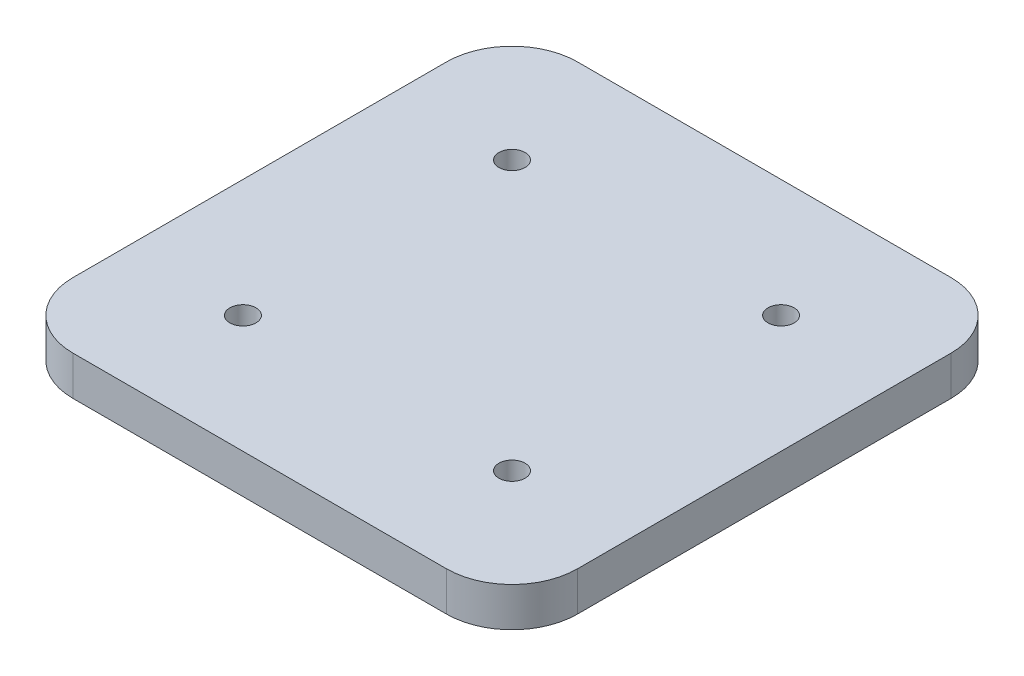
ISO-10303-21;
HEADER;
FILE_DESCRIPTION(('STEP AP214'),'2;1');
FILE_NAME('part.step','',(''),(''),'','','');
FILE_SCHEMA(('AUTOMOTIVE_DESIGN { 1 0 10303 214 1 1 1 1 }'));
ENDSEC;
DATA;
#1=APPLICATION_CONTEXT('core data for automotive mechanical design processes');
#2=APPLICATION_PROTOCOL_DEFINITION('international standard','automotive_design',2000,#1);
#3=PRODUCT_CONTEXT('',#1,'mechanical');
#4=PRODUCT('Part','Part','',(#3));
#5=PRODUCT_RELATED_PRODUCT_CATEGORY('part','',(#4));
#6=PRODUCT_DEFINITION_FORMATION('','',#4);
#7=PRODUCT_DEFINITION_CONTEXT('part definition',#1,'design');
#8=PRODUCT_DEFINITION('design','',#6,#7);
#9=PRODUCT_DEFINITION_SHAPE('','',#8);
#10=(LENGTH_UNIT() NAMED_UNIT(*) SI_UNIT(.MILLI.,.METRE.));
#11=(NAMED_UNIT(*) PLANE_ANGLE_UNIT() SI_UNIT($,.RADIAN.));
#12=(NAMED_UNIT(*) SI_UNIT($,.STERADIAN.) SOLID_ANGLE_UNIT());
#13=UNCERTAINTY_MEASURE_WITH_UNIT(LENGTH_MEASURE(1.E-05),#10,'distance_accuracy_value','');
#14=(GEOMETRIC_REPRESENTATION_CONTEXT(3) GLOBAL_UNCERTAINTY_ASSIGNED_CONTEXT((#13)) GLOBAL_UNIT_ASSIGNED_CONTEXT((#10,
#11,#12)) REPRESENTATION_CONTEXT('',''));
#15=CARTESIAN_POINT('',(0.,0.,0.));
#16=DIRECTION('',(0.,0.,1.));
#17=DIRECTION('',(1.,0.,0.));
#18=AXIS2_PLACEMENT_3D('',#15,#16,#17);
#19=CARTESIAN_POINT('',(25.4189986949346,71.5000000000009,-0.0199999999986694));
#20=DIRECTION('',(-1.,0.,0.));
#21=DIRECTION('',(0.,0.,1.));
#22=AXIS2_PLACEMENT_3D('',#19,#20,#21);
#23=PLANE('',#22);
#24=DIRECTION('',(0.,0.,-1.));
#25=VECTOR('',#24,1.);
#26=CARTESIAN_POINT('',(25.4189986949346,71.5000000000009,-0.0199999999986694));
#27=LINE('',#26,#25);
#28=CARTESIAN_POINT('',(25.4189986949346,71.5000000000009,-10.0199999999987));
#29=VERTEX_POINT('',#28);
#30=CARTESIAN_POINT('',(25.4189986949346,71.5000000000009,-67.1699999999987));
#31=VERTEX_POINT('',#30);
#32=EDGE_CURVE('E157',#29,#31,#27,.T.);
#33=ORIENTED_EDGE('',*,*,#32,.T.);
#34=DIRECTION('',(0.,-1.,0.));
#35=VECTOR('',#34,1.);
#36=CARTESIAN_POINT('',(25.4189986949346,71.5000000000009,-67.1699999999987));
#37=LINE('',#36,#35);
#38=CARTESIAN_POINT('',(25.4189986949346,65.5000000000009,-67.1699999999987));
#39=VERTEX_POINT('',#38);
#40=EDGE_CURVE('E11',#31,#39,#37,.T.);
#41=ORIENTED_EDGE('',*,*,#40,.T.);
#42=DIRECTION('',(0.,0.,-1.));
#43=VECTOR('',#42,1.);
#44=CARTESIAN_POINT('',(25.4189986949346,65.5000000000009,-0.0199999999986694));
#45=LINE('',#44,#43);
#46=CARTESIAN_POINT('',(25.4189986949346,65.5000000000009,-10.0199999999987));
#47=VERTEX_POINT('',#46);
#48=EDGE_CURVE('E160',#47,#39,#45,.T.);
#49=ORIENTED_EDGE('',*,*,#48,.F.);
#50=DIRECTION('',(0.,-1.,0.));
#51=VECTOR('',#50,1.);
#52=CARTESIAN_POINT('',(25.4189986949346,71.5000000000009,-10.0199999999987));
#53=LINE('',#52,#51);
#54=EDGE_CURVE('E43',#47,#29,#53,.F.);
#55=ORIENTED_EDGE('',*,*,#54,.T.);
#56=EDGE_LOOP('',(#33,#41,#49,#55));
#57=FACE_BOUND('',#56,.T.);
#58=ADVANCED_FACE('F35',(#57),#23,.T.);
#59=CARTESIAN_POINT('',(102.568998694935,71.5000000000009,-0.01999999999866));
#60=DIRECTION('',(0.,0.,1.));
#61=DIRECTION('',(1.,0.,0.));
#62=AXIS2_PLACEMENT_3D('',#59,#60,#61);
#63=PLANE('',#62);
#64=DIRECTION('',(-1.,0.,0.));
#65=VECTOR('',#64,1.);
#66=CARTESIAN_POINT('',(102.568998694935,65.5000000000009,-0.01999999999866));
#67=LINE('',#66,#65);
#68=CARTESIAN_POINT('',(92.5689986949346,65.5000000000009,-0.0199999999986612));
#69=VERTEX_POINT('',#68);
#70=CARTESIAN_POINT('',(35.4189986949346,65.5000000000009,-0.0199999999986682));
#71=VERTEX_POINT('',#70);
#72=EDGE_CURVE('E121',#69,#71,#67,.T.);
#73=ORIENTED_EDGE('',*,*,#72,.F.);
#74=DIRECTION('',(0.,-1.,0.));
#75=VECTOR('',#74,1.);
#76=CARTESIAN_POINT('',(92.5689986949346,71.5000000000009,-0.0199999999986612));
#77=LINE('',#76,#75);
#78=CARTESIAN_POINT('',(92.5689986949346,71.5000000000009,-0.0199999999986612));
#79=VERTEX_POINT('',#78);
#80=EDGE_CURVE('E141',#69,#79,#77,.F.);
#81=ORIENTED_EDGE('',*,*,#80,.T.);
#82=DIRECTION('',(-1.,0.,0.));
#83=VECTOR('',#82,1.);
#84=CARTESIAN_POINT('',(102.568998694935,71.5000000000009,-0.01999999999866));
#85=LINE('',#84,#83);
#86=CARTESIAN_POINT('',(35.4189986949346,71.5000000000009,-0.0199999999986682));
#87=VERTEX_POINT('',#86);
#88=EDGE_CURVE('E124',#79,#87,#85,.T.);
#89=ORIENTED_EDGE('',*,*,#88,.T.);
#90=DIRECTION('',(0.,-1.,0.));
#91=VECTOR('',#90,1.);
#92=CARTESIAN_POINT('',(35.4189986949346,71.5000000000009,-0.0199999999986682));
#93=LINE('',#92,#91);
#94=EDGE_CURVE('E138',#87,#71,#93,.T.);
#95=ORIENTED_EDGE('',*,*,#94,.T.);
#96=EDGE_LOOP('',(#73,#81,#89,#95));
#97=FACE_BOUND('',#96,.T.);
#98=ADVANCED_FACE('F172',(#97),#63,.T.);
#99=CARTESIAN_POINT('',(102.568998694935,71.5000000000009,-77.1699999999987));
#100=DIRECTION('',(1.,0.,0.));
#101=DIRECTION('',(0.,0.,-1.));
#102=AXIS2_PLACEMENT_3D('',#99,#100,#101);
#103=PLANE('',#102);
#104=DIRECTION('',(0.,0.,1.));
#105=VECTOR('',#104,1.);
#106=CARTESIAN_POINT('',(102.568998694935,71.5000000000009,-77.1699999999987));
#107=LINE('',#106,#105);
#108=CARTESIAN_POINT('',(102.568998694935,71.5000000000009,-67.1699999999987));
#109=VERTEX_POINT('',#108);
#110=CARTESIAN_POINT('',(102.568998694935,71.5000000000009,-10.0199999999987));
#111=VERTEX_POINT('',#110);
#112=EDGE_CURVE('E129',#109,#111,#107,.T.);
#113=ORIENTED_EDGE('',*,*,#112,.T.);
#114=DIRECTION('',(0.,-1.,0.));
#115=VECTOR('',#114,1.);
#116=CARTESIAN_POINT('',(102.568998694935,71.5000000000009,-10.0199999999987));
#117=LINE('',#116,#115);
#118=CARTESIAN_POINT('',(102.568998694935,65.5000000000009,-10.0199999999987));
#119=VERTEX_POINT('',#118);
#120=EDGE_CURVE('E120',#111,#119,#117,.T.);
#121=ORIENTED_EDGE('',*,*,#120,.T.);
#122=DIRECTION('',(0.,0.,1.));
#123=VECTOR('',#122,1.);
#124=CARTESIAN_POINT('',(102.568998694935,65.5000000000009,-77.1699999999987));
#125=LINE('',#124,#123);
#126=CARTESIAN_POINT('',(102.568998694935,65.5000000000009,-67.1699999999987));
#127=VERTEX_POINT('',#126);
#128=EDGE_CURVE('E105',#127,#119,#125,.T.);
#129=ORIENTED_EDGE('',*,*,#128,.F.);
#130=DIRECTION('',(0.,-1.,0.));
#131=VECTOR('',#130,1.);
#132=CARTESIAN_POINT('',(102.568998694935,71.5000000000009,-67.1699999999987));
#133=LINE('',#132,#131);
#134=EDGE_CURVE('E118',#127,#109,#133,.F.);
#135=ORIENTED_EDGE('',*,*,#134,.T.);
#136=EDGE_LOOP('',(#113,#121,#129,#135));
#137=FACE_BOUND('',#136,.T.);
#138=ADVANCED_FACE('F117',(#137),#103,.T.);
#139=CARTESIAN_POINT('',(25.4189986949346,71.5000000000009,-77.1699999999987));
#140=DIRECTION('',(0.,0.,-1.));
#141=DIRECTION('',(-1.,0.,0.));
#142=AXIS2_PLACEMENT_3D('',#139,#140,#141);
#143=PLANE('',#142);
#144=DIRECTION('',(1.,0.,0.));
#145=VECTOR('',#144,1.);
#146=CARTESIAN_POINT('',(25.4189986949346,71.5000000000009,-77.1699999999987));
#147=LINE('',#146,#145);
#148=CARTESIAN_POINT('',(35.4189986949346,71.5000000000009,-77.1699999999987));
#149=VERTEX_POINT('',#148);
#150=CARTESIAN_POINT('',(92.5689986949346,71.5000000000009,-77.1699999999987));
#151=VERTEX_POINT('',#150);
#152=EDGE_CURVE('E166',#149,#151,#147,.T.);
#153=ORIENTED_EDGE('',*,*,#152,.T.);
#154=DIRECTION('',(0.,-1.,0.));
#155=VECTOR('',#154,1.);
#156=CARTESIAN_POINT('',(92.5689986949346,71.5000000000009,-77.1699999999987));
#157=LINE('',#156,#155);
#158=CARTESIAN_POINT('',(92.5689986949346,65.5000000000009,-77.1699999999987));
#159=VERTEX_POINT('',#158);
#160=EDGE_CURVE('E151',#151,#159,#157,.T.);
#161=ORIENTED_EDGE('',*,*,#160,.T.);
#162=DIRECTION('',(1.,0.,0.));
#163=VECTOR('',#162,1.);
#164=CARTESIAN_POINT('',(25.4189986949346,65.5000000000009,-77.1699999999987));
#165=LINE('',#164,#163);
#166=CARTESIAN_POINT('',(35.4189986949346,65.5000000000009,-77.1699999999987));
#167=VERTEX_POINT('',#166);
#168=EDGE_CURVE('E106',#167,#159,#165,.T.);
#169=ORIENTED_EDGE('',*,*,#168,.F.);
#170=DIRECTION('',(0.,-1.,0.));
#171=VECTOR('',#170,1.);
#172=CARTESIAN_POINT('',(35.4189986949346,71.5000000000009,-77.1699999999987));
#173=LINE('',#172,#171);
#174=EDGE_CURVE('E57',#167,#149,#173,.F.);
#175=ORIENTED_EDGE('',*,*,#174,.T.);
#176=EDGE_LOOP('',(#153,#161,#169,#175));
#177=FACE_BOUND('',#176,.T.);
#178=ADVANCED_FACE('F210',(#177),#143,.T.);
#179=CARTESIAN_POINT('',(0.,71.5000000000009,0.));
#180=DIRECTION('',(0.,-1.,0.));
#181=DIRECTION('',(0.,0.,-1.));
#182=AXIS2_PLACEMENT_3D('',#179,#180,#181);
#183=PLANE('',#182);
#184=CARTESIAN_POINT('',(43.4189986949346,71.5000000000009,-59.1699999999987));
#185=DIRECTION('',(0.,1.,0.));
#186=DIRECTION('',(0.,0.,1.));
#187=AXIS2_PLACEMENT_3D('',#184,#185,#186);
#188=CIRCLE('',#187,2.);
#189=CARTESIAN_POINT('',(43.4189986949346,71.5000000000009,-57.1699999999987));
#190=VERTEX_POINT('',#189);
#191=EDGE_CURVE('E197',#190,#190,#188,.T.);
#192=ORIENTED_EDGE('',*,*,#191,.F.);
#193=EDGE_LOOP('',(#192));
#194=FACE_BOUND('',#193,.T.);
#195=CARTESIAN_POINT('',(43.4189986949346,71.5000000000009,-18.0199999999987));
#196=DIRECTION('',(0.,1.,0.));
#197=DIRECTION('',(0.,0.,1.));
#198=AXIS2_PLACEMENT_3D('',#195,#196,#197);
#199=CIRCLE('',#198,2.);
#200=CARTESIAN_POINT('',(43.4189986949346,71.5000000000009,-16.0199999999987));
#201=VERTEX_POINT('',#200);
#202=EDGE_CURVE('E200',#201,#201,#199,.T.);
#203=ORIENTED_EDGE('',*,*,#202,.F.);
#204=EDGE_LOOP('',(#203));
#205=FACE_BOUND('',#204,.T.);
#206=CARTESIAN_POINT('',(84.5689986949346,71.5000000000009,-18.0199999999987));
#207=DIRECTION('',(0.,1.,0.));
#208=DIRECTION('',(0.,0.,1.));
#209=AXIS2_PLACEMENT_3D('',#206,#207,#208);
#210=CIRCLE('',#209,2.);
#211=CARTESIAN_POINT('',(84.5689986949346,71.5000000000009,-16.0199999999987));
#212=VERTEX_POINT('',#211);
#213=EDGE_CURVE('E196',#212,#212,#210,.T.);
#214=ORIENTED_EDGE('',*,*,#213,.F.);
#215=EDGE_LOOP('',(#214));
#216=FACE_BOUND('',#215,.T.);
#217=CARTESIAN_POINT('',(84.5689986949346,71.5000000000009,-59.1699999999987));
#218=DIRECTION('',(0.,1.,0.));
#219=DIRECTION('',(0.,0.,1.));
#220=AXIS2_PLACEMENT_3D('',#217,#218,#219);
#221=CIRCLE('',#220,2.);
#222=CARTESIAN_POINT('',(84.5689986949346,71.5000000000009,-57.1699999999987));
#223=VERTEX_POINT('',#222);
#224=EDGE_CURVE('E181',#223,#223,#221,.T.);
#225=ORIENTED_EDGE('',*,*,#224,.F.);
#226=EDGE_LOOP('',(#225));
#227=FACE_BOUND('',#226,.T.);
#228=ORIENTED_EDGE('',*,*,#88,.F.);
#229=CARTESIAN_POINT('',(92.5689986949346,71.5000000000009,-10.0199999999987));
#230=DIRECTION('',(0.,-1.,0.));
#231=DIRECTION('',(0.,0.,-1.));
#232=AXIS2_PLACEMENT_3D('',#229,#230,#231);
#233=CIRCLE('',#232,10.);
#234=EDGE_CURVE('E148',#79,#111,#233,.F.);
#235=ORIENTED_EDGE('',*,*,#234,.T.);
#236=ORIENTED_EDGE('',*,*,#112,.F.);
#237=CARTESIAN_POINT('',(92.5689986949346,71.5000000000009,-67.1699999999987));
#238=DIRECTION('',(0.,-1.,0.));
#239=DIRECTION('',(0.,0.,-1.));
#240=AXIS2_PLACEMENT_3D('',#237,#238,#239);
#241=CIRCLE('',#240,10.);
#242=EDGE_CURVE('E50',#109,#151,#241,.F.);
#243=ORIENTED_EDGE('',*,*,#242,.T.);
#244=ORIENTED_EDGE('',*,*,#152,.F.);
#245=CARTESIAN_POINT('',(35.4189986949346,71.5000000000009,-67.1699999999987));
#246=DIRECTION('',(0.,-1.,0.));
#247=DIRECTION('',(0.,0.,-1.));
#248=AXIS2_PLACEMENT_3D('',#245,#246,#247);
#249=CIRCLE('',#248,10.);
#250=EDGE_CURVE('E145',#149,#31,#249,.F.);
#251=ORIENTED_EDGE('',*,*,#250,.T.);
#252=ORIENTED_EDGE('',*,*,#32,.F.);
#253=CARTESIAN_POINT('',(35.4189986949346,71.5000000000009,-10.0199999999987));
#254=DIRECTION('',(0.,-1.,0.));
#255=DIRECTION('',(0.,0.,-1.));
#256=AXIS2_PLACEMENT_3D('',#253,#254,#255);
#257=CIRCLE('',#256,10.);
#258=EDGE_CURVE('E143',#29,#87,#257,.F.);
#259=ORIENTED_EDGE('',*,*,#258,.T.);
#260=EDGE_LOOP('',(#228,#235,#236,#243,#244,#251,#252,#259));
#261=FACE_BOUND('',#260,.T.);
#262=ADVANCED_FACE('F164',(#194,#205,#216,#227,#261),#183,.F.);
#263=CARTESIAN_POINT('',(0.,65.5000000000009,0.));
#264=DIRECTION('',(0.,-1.,0.));
#265=DIRECTION('',(0.,0.,-1.));
#266=AXIS2_PLACEMENT_3D('',#263,#264,#265);
#267=PLANE('',#266);
#268=CARTESIAN_POINT('',(43.4189986949346,65.5000000000009,-59.1699999999987));
#269=DIRECTION('',(0.,-1.,0.));
#270=DIRECTION('',(0.,0.,-1.));
#271=AXIS2_PLACEMENT_3D('',#268,#269,#270);
#272=CIRCLE('',#271,2.);
#273=CARTESIAN_POINT('',(43.4189986949346,65.5000000000009,-61.1699999999987));
#274=VERTEX_POINT('',#273);
#275=EDGE_CURVE('E132',#274,#274,#272,.T.);
#276=ORIENTED_EDGE('',*,*,#275,.F.);
#277=EDGE_LOOP('',(#276));
#278=FACE_BOUND('',#277,.T.);
#279=CARTESIAN_POINT('',(43.4189986949346,65.5000000000009,-18.0199999999987));
#280=DIRECTION('',(0.,-1.,0.));
#281=DIRECTION('',(0.,0.,-1.));
#282=AXIS2_PLACEMENT_3D('',#279,#280,#281);
#283=CIRCLE('',#282,2.);
#284=CARTESIAN_POINT('',(43.4189986949346,65.5000000000009,-20.0199999999987));
#285=VERTEX_POINT('',#284);
#286=EDGE_CURVE('E183',#285,#285,#283,.T.);
#287=ORIENTED_EDGE('',*,*,#286,.F.);
#288=EDGE_LOOP('',(#287));
#289=FACE_BOUND('',#288,.T.);
#290=CARTESIAN_POINT('',(84.5689986949346,65.5000000000009,-18.0199999999987));
#291=DIRECTION('',(0.,-1.,0.));
#292=DIRECTION('',(0.,0.,-1.));
#293=AXIS2_PLACEMENT_3D('',#290,#291,#292);
#294=CIRCLE('',#293,2.);
#295=CARTESIAN_POINT('',(84.5689986949346,65.5000000000009,-20.0199999999987));
#296=VERTEX_POINT('',#295);
#297=EDGE_CURVE('E180',#296,#296,#294,.T.);
#298=ORIENTED_EDGE('',*,*,#297,.F.);
#299=EDGE_LOOP('',(#298));
#300=FACE_BOUND('',#299,.T.);
#301=CARTESIAN_POINT('',(84.5689986949346,65.5000000000009,-59.1699999999987));
#302=DIRECTION('',(0.,-1.,0.));
#303=DIRECTION('',(0.,0.,-1.));
#304=AXIS2_PLACEMENT_3D('',#301,#302,#303);
#305=CIRCLE('',#304,2.);
#306=CARTESIAN_POINT('',(84.5689986949346,65.5000000000009,-61.1699999999987));
#307=VERTEX_POINT('',#306);
#308=EDGE_CURVE('E177',#307,#307,#305,.T.);
#309=ORIENTED_EDGE('',*,*,#308,.F.);
#310=EDGE_LOOP('',(#309));
#311=FACE_BOUND('',#310,.T.);
#312=ORIENTED_EDGE('',*,*,#128,.T.);
#313=CARTESIAN_POINT('',(92.5689986949346,65.5000000000009,-10.0199999999987));
#314=DIRECTION('',(0.,-1.,0.));
#315=DIRECTION('',(0.,0.,-1.));
#316=AXIS2_PLACEMENT_3D('',#313,#314,#315);
#317=CIRCLE('',#316,10.);
#318=EDGE_CURVE('E111',#119,#69,#317,.T.);
#319=ORIENTED_EDGE('',*,*,#318,.T.);
#320=ORIENTED_EDGE('',*,*,#72,.T.);
#321=CARTESIAN_POINT('',(35.4189986949346,65.5000000000009,-10.0199999999987));
#322=DIRECTION('',(0.,-1.,0.));
#323=DIRECTION('',(0.,0.,-1.));
#324=AXIS2_PLACEMENT_3D('',#321,#322,#323);
#325=CIRCLE('',#324,10.);
#326=EDGE_CURVE('E126',#71,#47,#325,.T.);
#327=ORIENTED_EDGE('',*,*,#326,.T.);
#328=ORIENTED_EDGE('',*,*,#48,.T.);
#329=CARTESIAN_POINT('',(35.4189986949346,65.5000000000009,-67.1699999999987));
#330=DIRECTION('',(0.,-1.,0.));
#331=DIRECTION('',(0.,0.,-1.));
#332=AXIS2_PLACEMENT_3D('',#329,#330,#331);
#333=CIRCLE('',#332,10.);
#334=EDGE_CURVE('E112',#39,#167,#333,.T.);
#335=ORIENTED_EDGE('',*,*,#334,.T.);
#336=ORIENTED_EDGE('',*,*,#168,.T.);
#337=CARTESIAN_POINT('',(92.5689986949346,65.5000000000009,-67.1699999999987));
#338=DIRECTION('',(0.,-1.,0.));
#339=DIRECTION('',(0.,0.,-1.));
#340=AXIS2_PLACEMENT_3D('',#337,#338,#339);
#341=CIRCLE('',#340,10.);
#342=EDGE_CURVE('E102',#159,#127,#341,.T.);
#343=ORIENTED_EDGE('',*,*,#342,.T.);
#344=EDGE_LOOP('',(#312,#319,#320,#327,#328,#335,#336,#343));
#345=FACE_BOUND('',#344,.T.);
#346=ADVANCED_FACE('F104',(#278,#289,#300,#311,#345),#267,.T.);
#347=CARTESIAN_POINT('',(84.5689986949346,31.5000000000009,-59.1699999999987));
#348=DIRECTION('',(0.,1.,0.));
#349=DIRECTION('',(0.,0.,1.));
#350=AXIS2_PLACEMENT_3D('',#347,#348,#349);
#351=CYLINDRICAL_SURFACE('',#350,2.);
#352=ORIENTED_EDGE('',*,*,#308,.T.);
#353=EDGE_LOOP('',(#352));
#354=FACE_BOUND('',#353,.T.);
#355=ORIENTED_EDGE('',*,*,#224,.T.);
#356=EDGE_LOOP('',(#355));
#357=FACE_BOUND('',#356,.T.);
#358=ADVANCED_FACE('F215',(#354,#357),#351,.F.);
#359=CARTESIAN_POINT('',(84.5689986949346,31.5000000000009,-18.0199999999987));
#360=DIRECTION('',(0.,1.,0.));
#361=DIRECTION('',(0.,0.,1.));
#362=AXIS2_PLACEMENT_3D('',#359,#360,#361);
#363=CYLINDRICAL_SURFACE('',#362,2.);
#364=ORIENTED_EDGE('',*,*,#297,.T.);
#365=EDGE_LOOP('',(#364));
#366=FACE_BOUND('',#365,.T.);
#367=ORIENTED_EDGE('',*,*,#213,.T.);
#368=EDGE_LOOP('',(#367));
#369=FACE_BOUND('',#368,.T.);
#370=ADVANCED_FACE('F206',(#366,#369),#363,.F.);
#371=CARTESIAN_POINT('',(43.4189986949346,31.5000000000009,-18.0199999999987));
#372=DIRECTION('',(0.,1.,0.));
#373=DIRECTION('',(0.,0.,1.));
#374=AXIS2_PLACEMENT_3D('',#371,#372,#373);
#375=CYLINDRICAL_SURFACE('',#374,2.);
#376=ORIENTED_EDGE('',*,*,#286,.T.);
#377=EDGE_LOOP('',(#376));
#378=FACE_BOUND('',#377,.T.);
#379=ORIENTED_EDGE('',*,*,#202,.T.);
#380=EDGE_LOOP('',(#379));
#381=FACE_BOUND('',#380,.T.);
#382=ADVANCED_FACE('F223',(#378,#381),#375,.F.);
#383=CARTESIAN_POINT('',(43.4189986949346,31.5000000000009,-59.1699999999987));
#384=DIRECTION('',(0.,1.,0.));
#385=DIRECTION('',(0.,0.,1.));
#386=AXIS2_PLACEMENT_3D('',#383,#384,#385);
#387=CYLINDRICAL_SURFACE('',#386,2.);
#388=ORIENTED_EDGE('',*,*,#275,.T.);
#389=EDGE_LOOP('',(#388));
#390=FACE_BOUND('',#389,.T.);
#391=ORIENTED_EDGE('',*,*,#191,.T.);
#392=EDGE_LOOP('',(#391));
#393=FACE_BOUND('',#392,.T.);
#394=ADVANCED_FACE('F241',(#390,#393),#387,.F.);
#395=CARTESIAN_POINT('',(92.5689986949346,71.5000000000009,-10.0199999999987));
#396=DIRECTION('',(0.,-1.,0.));
#397=DIRECTION('',(0.,0.,-1.));
#398=AXIS2_PLACEMENT_3D('',#395,#396,#397);
#399=CYLINDRICAL_SURFACE('',#398,10.);
#400=ORIENTED_EDGE('',*,*,#234,.F.);
#401=ORIENTED_EDGE('',*,*,#80,.F.);
#402=ORIENTED_EDGE('',*,*,#318,.F.);
#403=ORIENTED_EDGE('',*,*,#120,.F.);
#404=EDGE_LOOP('',(#400,#401,#402,#403));
#405=FACE_BOUND('',#404,.T.);
#406=ADVANCED_FACE('F238',(#405),#399,.T.);
#407=CARTESIAN_POINT('',(92.5689986949346,71.5000000000009,-67.1699999999987));
#408=DIRECTION('',(0.,-1.,0.));
#409=DIRECTION('',(0.,0.,-1.));
#410=AXIS2_PLACEMENT_3D('',#407,#408,#409);
#411=CYLINDRICAL_SURFACE('',#410,10.);
#412=ORIENTED_EDGE('',*,*,#242,.F.);
#413=ORIENTED_EDGE('',*,*,#134,.F.);
#414=ORIENTED_EDGE('',*,*,#342,.F.);
#415=ORIENTED_EDGE('',*,*,#160,.F.);
#416=EDGE_LOOP('',(#412,#413,#414,#415));
#417=FACE_BOUND('',#416,.T.);
#418=ADVANCED_FACE('F123',(#417),#411,.T.);
#419=CARTESIAN_POINT('',(35.4189986949346,71.5000000000009,-67.1699999999987));
#420=DIRECTION('',(0.,-1.,0.));
#421=DIRECTION('',(0.,0.,-1.));
#422=AXIS2_PLACEMENT_3D('',#419,#420,#421);
#423=CYLINDRICAL_SURFACE('',#422,10.);
#424=ORIENTED_EDGE('',*,*,#250,.F.);
#425=ORIENTED_EDGE('',*,*,#174,.F.);
#426=ORIENTED_EDGE('',*,*,#334,.F.);
#427=ORIENTED_EDGE('',*,*,#40,.F.);
#428=EDGE_LOOP('',(#424,#425,#426,#427));
#429=FACE_BOUND('',#428,.T.);
#430=ADVANCED_FACE('F244',(#429),#423,.T.);
#431=CARTESIAN_POINT('',(35.4189986949346,71.5000000000009,-10.0199999999987));
#432=DIRECTION('',(0.,-1.,0.));
#433=DIRECTION('',(0.,0.,-1.));
#434=AXIS2_PLACEMENT_3D('',#431,#432,#433);
#435=CYLINDRICAL_SURFACE('',#434,10.);
#436=ORIENTED_EDGE('',*,*,#258,.F.);
#437=ORIENTED_EDGE('',*,*,#54,.F.);
#438=ORIENTED_EDGE('',*,*,#326,.F.);
#439=ORIENTED_EDGE('',*,*,#94,.F.);
#440=EDGE_LOOP('',(#436,#437,#438,#439));
#441=FACE_BOUND('',#440,.T.);
#442=ADVANCED_FACE('F37',(#441),#435,.T.);
#443=CLOSED_SHELL('',(#58,#98,#138,#178,#262,#346,#358,#370,#382,#394,#406,#418,#430,#442));
#444=MANIFOLD_SOLID_BREP('B2',#443);
#445=ADVANCED_BREP_SHAPE_REPRESENTATION('',(#18,#444),#14);
#446=SHAPE_DEFINITION_REPRESENTATION(#9,#445);
ENDSEC;
END-ISO-10303-21;
